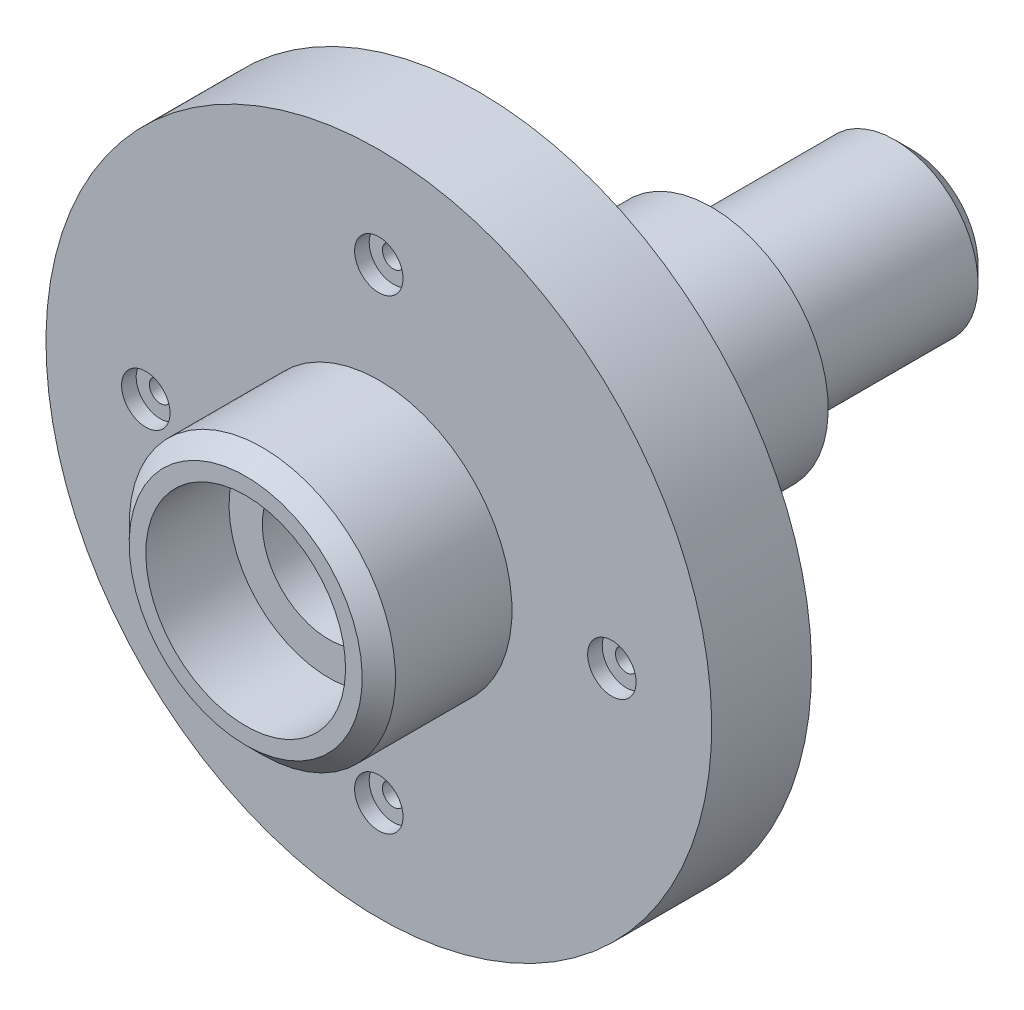
ISO-10303-21;
HEADER;
FILE_DESCRIPTION(('STEP AP214'),'2;1');
FILE_NAME('part.step','',(''),(''),'','','');
FILE_SCHEMA(('AUTOMOTIVE_DESIGN { 1 0 10303 214 1 1 1 1 }'));
ENDSEC;
DATA;
#1=APPLICATION_CONTEXT('core data for automotive mechanical design processes');
#2=APPLICATION_PROTOCOL_DEFINITION('international standard','automotive_design',2000,#1);
#3=PRODUCT_CONTEXT('',#1,'mechanical');
#4=PRODUCT('Part','Part','',(#3));
#5=PRODUCT_RELATED_PRODUCT_CATEGORY('part','',(#4));
#6=PRODUCT_DEFINITION_FORMATION('','',#4);
#7=PRODUCT_DEFINITION_CONTEXT('part definition',#1,'design');
#8=PRODUCT_DEFINITION('design','',#6,#7);
#9=PRODUCT_DEFINITION_SHAPE('','',#8);
#10=(LENGTH_UNIT() NAMED_UNIT(*) SI_UNIT(.MILLI.,.METRE.));
#11=(NAMED_UNIT(*) PLANE_ANGLE_UNIT() SI_UNIT($,.RADIAN.));
#12=(NAMED_UNIT(*) SI_UNIT($,.STERADIAN.) SOLID_ANGLE_UNIT());
#13=UNCERTAINTY_MEASURE_WITH_UNIT(LENGTH_MEASURE(1.E-05),#10,'distance_accuracy_value','');
#14=(GEOMETRIC_REPRESENTATION_CONTEXT(3) GLOBAL_UNCERTAINTY_ASSIGNED_CONTEXT((#13)) GLOBAL_UNIT_ASSIGNED_CONTEXT((#10,
#11,#12)) REPRESENTATION_CONTEXT('',''));
#15=CARTESIAN_POINT('',(0.,0.,0.));
#16=DIRECTION('',(0.,0.,1.));
#17=DIRECTION('',(1.,0.,0.));
#18=AXIS2_PLACEMENT_3D('',#15,#16,#17);
#19=CARTESIAN_POINT('',(0.,25.,0.));
#20=DIRECTION('',(0.,0.,-1.));
#21=DIRECTION('',(0.,1.,0.));
#22=AXIS2_PLACEMENT_3D('',#19,#20,#21);
#23=PLANE('',#22);
#24=CARTESIAN_POINT('',(0.,0.,0.));
#25=DIRECTION('',(0.,0.,-1.));
#26=DIRECTION('',(0.,1.,0.));
#27=AXIS2_PLACEMENT_3D('',#24,#25,#26);
#28=CIRCLE('',#27,9.24999999999999);
#29=CARTESIAN_POINT('',(0.,9.24999999999999,0.));
#30=VERTEX_POINT('',#29);
#31=EDGE_CURVE('E82',#30,#30,#28,.T.);
#32=ORIENTED_EDGE('',*,*,#31,.F.);
#33=EDGE_LOOP('',(#32));
#34=FACE_BOUND('',#33,.T.);
#35=CARTESIAN_POINT('',(0.,0.,0.));
#36=DIRECTION('',(0.,0.,-1.));
#37=DIRECTION('',(0.,1.,0.));
#38=AXIS2_PLACEMENT_3D('',#35,#36,#37);
#39=CIRCLE('',#38,20.0000000000001);
#40=CARTESIAN_POINT('',(0.,20.0000000000001,0.));
#41=VERTEX_POINT('',#40);
#42=EDGE_CURVE('E266',#41,#41,#39,.T.);
#43=ORIENTED_EDGE('',*,*,#42,.T.);
#44=EDGE_LOOP('',(#43));
#45=FACE_BOUND('',#44,.T.);
#46=ADVANCED_FACE('F40',(#34,#45),#23,.T.);
#47=CARTESIAN_POINT('',(0.,0.,0.));
#48=DIRECTION('',(0.,0.,-1.));
#49=DIRECTION('',(0.,1.,0.));
#50=AXIS2_PLACEMENT_3D('',#47,#48,#49);
#51=CYLINDRICAL_SURFACE('',#50,25.);
#52=CARTESIAN_POINT('',(0.,0.,4.99999999999999));
#53=DIRECTION('',(0.,0.,-1.));
#54=DIRECTION('',(0.,1.,0.));
#55=AXIS2_PLACEMENT_3D('',#52,#53,#54);
#56=CIRCLE('',#55,25.);
#57=CARTESIAN_POINT('',(0.,25.,4.99999999999999));
#58=VERTEX_POINT('',#57);
#59=EDGE_CURVE('E263',#58,#58,#56,.F.);
#60=ORIENTED_EDGE('',*,*,#59,.T.);
#61=EDGE_LOOP('',(#60));
#62=FACE_BOUND('',#61,.T.);
#63=CARTESIAN_POINT('',(0.,0.,60.));
#64=DIRECTION('',(0.,0.,-1.));
#65=DIRECTION('',(0.,1.,0.));
#66=AXIS2_PLACEMENT_3D('',#63,#64,#65);
#67=CIRCLE('',#66,25.);
#68=CARTESIAN_POINT('',(0.,25.,60.));
#69=VERTEX_POINT('',#68);
#70=EDGE_CURVE('E156',#69,#69,#67,.T.);
#71=ORIENTED_EDGE('',*,*,#70,.T.);
#72=EDGE_LOOP('',(#71));
#73=FACE_BOUND('',#72,.T.);
#74=ADVANCED_FACE('F233',(#62,#73),#51,.T.);
#75=CARTESIAN_POINT('',(0.,35.,60.));
#76=DIRECTION('',(0.,0.,-1.));
#77=DIRECTION('',(0.,1.,0.));
#78=AXIS2_PLACEMENT_3D('',#75,#76,#77);
#79=PLANE('',#78);
#80=CARTESIAN_POINT('',(0.,0.,60.));
#81=DIRECTION('',(0.,0.,-1.));
#82=DIRECTION('',(0.,1.,0.));
#83=AXIS2_PLACEMENT_3D('',#80,#81,#82);
#84=CIRCLE('',#83,35.);
#85=CARTESIAN_POINT('',(0.,35.,60.));
#86=VERTEX_POINT('',#85);
#87=EDGE_CURVE('E153',#86,#86,#84,.T.);
#88=ORIENTED_EDGE('',*,*,#87,.T.);
#89=EDGE_LOOP('',(#88));
#90=FACE_BOUND('',#89,.T.);
#91=ORIENTED_EDGE('',*,*,#70,.F.);
#92=EDGE_LOOP('',(#91));
#93=FACE_BOUND('',#92,.T.);
#94=ADVANCED_FACE('F228',(#90,#93),#79,.T.);
#95=CARTESIAN_POINT('',(0.,0.,0.));
#96=DIRECTION('',(0.,0.,-1.));
#97=DIRECTION('',(0.,1.,0.));
#98=AXIS2_PLACEMENT_3D('',#95,#96,#97);
#99=CYLINDRICAL_SURFACE('',#98,35.);
#100=DIRECTION('',(0.,0.,-1.));
#101=VECTOR('',#100,1.);
#102=CARTESIAN_POINT('',(10.,-33.5410196624969,0.));
#103=LINE('',#102,#101);
#104=CARTESIAN_POINT('',(10.,-33.5410196624969,64.9180948440976));
#105=VERTEX_POINT('',#104);
#106=CARTESIAN_POINT('',(10.,-33.5410196624969,115.081905155902));
#107=VERTEX_POINT('',#106);
#108=EDGE_CURVE('E62',#105,#107,#103,.F.);
#109=ORIENTED_EDGE('',*,*,#108,.F.);
#110=CARTESIAN_POINT('',(10.,-33.5410196624969,64.9180948440976));
#111=CARTESIAN_POINT('',(9.59845060295868,-33.6607514649792,64.839545568527));
#112=CARTESIAN_POINT('',(9.19372904055648,-33.7735514212323,64.7667321751121));
#113=CARTESIAN_POINT('',(8.37879790741143,-33.9848893569313,64.6320636996973));
#114=CARTESIAN_POINT('',(7.9685886252481,-34.0834280831288,64.5702080438866));
#115=CARTESIAN_POINT('',(7.14364584982962,-34.2658247972242,64.4569540243449));
#116=CARTESIAN_POINT('',(6.72891405248233,-34.349688099932,64.405551873704));
#117=CARTESIAN_POINT('',(5.89562437601432,-34.5024798359342,64.3127500488721));
#118=CARTESIAN_POINT('',(5.4770664636555,-34.5714081393571,64.2713504616609));
#119=CARTESIAN_POINT('',(4.24006682776616,-34.7520194622488,64.1636136746691));
#120=CARTESIAN_POINT('',(3.41723922779747,-34.8426132780873,64.1106433580321));
#121=CARTESIAN_POINT('',(1.76578200985539,-34.965239366976,64.0392434494645));
#122=CARTESIAN_POINT('',(0.937151842066425,-34.9972660130793,64.0208171764111));
#123=CARTESIAN_POINT('',(-0.737897715208506,-35.0024525843351,64.0178210484575));
#124=CARTESIAN_POINT('',(-1.58432263132521,-34.97435297598,64.0339756005816));
#125=CARTESIAN_POINT('',(-3.27153298615267,-34.8570201041887,64.102222477832));
#126=CARTESIAN_POINT('',(-4.11231876536465,-34.7677905660639,64.1543126130137));
#127=CARTESIAN_POINT('',(-5.37658407839591,-34.5872937340155,64.2618315830102));
#128=CARTESIAN_POINT('',(-5.80453751966936,-34.518036186317,64.3033685363203));
#129=CARTESIAN_POINT('',(-6.65650517215929,-34.3639093076495,64.3968587179929));
#130=CARTESIAN_POINT('',(-7.08051941660013,-34.2790401084796,64.4488118584187));
#131=CARTESIAN_POINT('',(-7.923852776155,-34.0939722228412,64.5636048387531));
#132=CARTESIAN_POINT('',(-8.34317024183908,-33.9937683216866,64.6264483829954));
#133=CARTESIAN_POINT('',(-9.1760958273764,-33.7784628384606,64.7635633184889));
#134=CARTESIAN_POINT('',(-9.58970363387191,-33.6633604422984,64.8378353342621));
#135=CARTESIAN_POINT('',(-10.,-33.5410196624969,64.9180948440976));
#136=B_SPLINE_CURVE_WITH_KNOTS('',3,(#110,#111,#112,#113,#114,#115,#116,#117,#118,#119,#120,
#121,#122,#123,#124,#125,#126,#127,#128,#129,#130,#131,#132,#133,#134,#135),.UNSPECIFIED.,.F.,
.F.,(4,2,2,2,2,2,2,2,2,2,2,2,4),(0.,1.2788248405163,2.55758269451853,3.83587647441616,
5.11418136963851,7.59957411008348,10.0852056265931,12.6234155189922,15.161470744416,
16.467640815109,17.7737998591545,19.0804040639262,20.3870796949689),.UNSPECIFIED.);
#137=CARTESIAN_POINT('',(-10.,-33.5410196624969,64.9180948440976));
#138=VERTEX_POINT('',#137);
#139=EDGE_CURVE('E171',#105,#138,#136,.T.);
#140=ORIENTED_EDGE('',*,*,#139,.T.);
#141=DIRECTION('',(0.,0.,-1.));
#142=VECTOR('',#141,1.);
#143=CARTESIAN_POINT('',(-10.,-33.5410196624969,0.));
#144=LINE('',#143,#142);
#145=CARTESIAN_POINT('',(-10.,-33.5410196624969,115.081905155902));
#146=VERTEX_POINT('',#145);
#147=EDGE_CURVE('E159',#138,#146,#144,.F.);
#148=ORIENTED_EDGE('',*,*,#147,.T.);
#149=CARTESIAN_POINT('',(-10.,-33.5410196624969,115.081905155902));
#150=CARTESIAN_POINT('',(-9.59845060295868,-33.6607514649792,115.160454431473));
#151=CARTESIAN_POINT('',(-9.19372904055648,-33.7735514212323,115.233267824888));
#152=CARTESIAN_POINT('',(-8.37879790741143,-33.9848893569313,115.367936300303));
#153=CARTESIAN_POINT('',(-7.9685886252481,-34.0834280831289,115.429791956114));
#154=CARTESIAN_POINT('',(-7.14364584982962,-34.2658247972242,115.543045975655));
#155=CARTESIAN_POINT('',(-6.72891405248233,-34.349688099932,115.594448126296));
#156=CARTESIAN_POINT('',(-5.89562437601432,-34.5024798359342,115.687249951128));
#157=CARTESIAN_POINT('',(-5.47706646365551,-34.5714081393571,115.728649538339));
#158=CARTESIAN_POINT('',(-4.24006682776616,-34.7520194622488,115.836386325331));
#159=CARTESIAN_POINT('',(-3.41723922779747,-34.8426132780873,115.889356641968));
#160=CARTESIAN_POINT('',(-1.7657820098554,-34.965239366976,115.960756550536));
#161=CARTESIAN_POINT('',(-0.93715184206643,-34.9972660130793,115.979182823589));
#162=CARTESIAN_POINT('',(0.737897715208501,-35.0024525843351,115.982178951543));
#163=CARTESIAN_POINT('',(1.58432263132521,-34.9743529759801,115.966024399418));
#164=CARTESIAN_POINT('',(3.27153298615267,-34.8570201041887,115.897777522168));
#165=CARTESIAN_POINT('',(4.11231876536465,-34.7677905660639,115.845687386986));
#166=CARTESIAN_POINT('',(5.37658407839591,-34.5872937340155,115.73816841699));
#167=CARTESIAN_POINT('',(5.80453751966936,-34.518036186317,115.69663146368));
#168=CARTESIAN_POINT('',(6.65650517215929,-34.3639093076495,115.603141282007));
#169=CARTESIAN_POINT('',(7.08051941660012,-34.2790401084796,115.551188141581));
#170=CARTESIAN_POINT('',(7.923852776155,-34.0939722228412,115.436395161247));
#171=CARTESIAN_POINT('',(8.34317024183908,-33.9937683216866,115.373551617005));
#172=CARTESIAN_POINT('',(9.1760958273764,-33.7784628384606,115.236436681511));
#173=CARTESIAN_POINT('',(9.5897036338719,-33.6633604422984,115.162164665738));
#174=CARTESIAN_POINT('',(10.,-33.5410196624969,115.081905155902));
#175=B_SPLINE_CURVE_WITH_KNOTS('',3,(#149,#150,#151,#152,#153,#154,#155,#156,#157,#158,#159,
#160,#161,#162,#163,#164,#165,#166,#167,#168,#169,#170,#171,#172,#173,#174),.UNSPECIFIED.,.F.,
.F.,(4,2,2,2,2,2,2,2,2,2,2,2,4),(0.,1.2788248405163,2.55758269451853,3.83587647441616,
5.11418136963851,7.59957411008348,10.0852056265931,12.6234155189922,15.161470744416,
16.467640815109,17.7737998591545,19.0804040639262,20.3870796949689),.UNSPECIFIED.);
#176=EDGE_CURVE('E162',#146,#107,#175,.T.);
#177=ORIENTED_EDGE('',*,*,#176,.T.);
#178=EDGE_LOOP('',(#109,#140,#148,#177));
#179=FACE_BOUND('',#178,.T.);
#180=CARTESIAN_POINT('',(0.,0.,130.));
#181=DIRECTION('',(0.,0.,-1.));
#182=DIRECTION('',(0.,1.,0.));
#183=AXIS2_PLACEMENT_3D('',#180,#181,#182);
#184=CIRCLE('',#183,35.);
#185=CARTESIAN_POINT('',(0.,35.,130.));
#186=VERTEX_POINT('',#185);
#187=EDGE_CURVE('E150',#186,#186,#184,.T.);
#188=ORIENTED_EDGE('',*,*,#187,.T.);
#189=EDGE_LOOP('',(#188));
#190=FACE_BOUND('',#189,.T.);
#191=ORIENTED_EDGE('',*,*,#87,.F.);
#192=EDGE_LOOP('',(#191));
#193=FACE_BOUND('',#192,.T.);
#194=ADVANCED_FACE('F177',(#179,#190,#193),#99,.T.);
#195=CARTESIAN_POINT('',(0.,100.,130.));
#196=DIRECTION('',(0.,0.,-1.));
#197=DIRECTION('',(0.,1.,0.));
#198=AXIS2_PLACEMENT_3D('',#195,#196,#197);
#199=PLANE('',#198);
#200=CARTESIAN_POINT('',(7.33211081157058E-13,70.,130.));
#201=DIRECTION('',(0.,0.,-1.));
#202=DIRECTION('',(0.,1.,0.));
#203=AXIS2_PLACEMENT_3D('',#200,#201,#202);
#204=CIRCLE('',#203,3.29999999999997);
#205=CARTESIAN_POINT('',(7.33211081157058E-13,73.3,130.));
#206=VERTEX_POINT('',#205);
#207=EDGE_CURVE('E95',#206,#206,#204,.T.);
#208=ORIENTED_EDGE('',*,*,#207,.F.);
#209=EDGE_LOOP('',(#208));
#210=FACE_BOUND('',#209,.T.);
#211=CARTESIAN_POINT('',(70.,0.,130.));
#212=DIRECTION('',(0.,0.,-1.));
#213=DIRECTION('',(0.,1.,0.));
#214=AXIS2_PLACEMENT_3D('',#211,#212,#213);
#215=CIRCLE('',#214,3.29999999999997);
#216=CARTESIAN_POINT('',(70.,3.29999999999995,130.));
#217=VERTEX_POINT('',#216);
#218=EDGE_CURVE('E105',#217,#217,#215,.T.);
#219=ORIENTED_EDGE('',*,*,#218,.F.);
#220=EDGE_LOOP('',(#219));
#221=FACE_BOUND('',#220,.T.);
#222=CARTESIAN_POINT('',(-2.44403693719019E-13,-70.,130.));
#223=DIRECTION('',(0.,0.,-1.));
#224=DIRECTION('',(0.,1.,0.));
#225=AXIS2_PLACEMENT_3D('',#222,#223,#224);
#226=CIRCLE('',#225,3.29999999999997);
#227=CARTESIAN_POINT('',(-2.44403693719019E-13,-66.7,130.));
#228=VERTEX_POINT('',#227);
#229=EDGE_CURVE('E115',#228,#228,#226,.T.);
#230=ORIENTED_EDGE('',*,*,#229,.F.);
#231=EDGE_LOOP('',(#230));
#232=FACE_BOUND('',#231,.T.);
#233=CARTESIAN_POINT('',(-70.,4.74258093768556E-13,130.));
#234=DIRECTION('',(0.,0.,-1.));
#235=DIRECTION('',(0.,1.,0.));
#236=AXIS2_PLACEMENT_3D('',#233,#234,#235);
#237=CIRCLE('',#236,3.29999999999997);
#238=CARTESIAN_POINT('',(-70.,3.30000000000044,130.));
#239=VERTEX_POINT('',#238);
#240=EDGE_CURVE('E125',#239,#239,#237,.T.);
#241=ORIENTED_EDGE('',*,*,#240,.F.);
#242=EDGE_LOOP('',(#241));
#243=FACE_BOUND('',#242,.T.);
#244=CARTESIAN_POINT('',(0.,0.,130.));
#245=DIRECTION('',(0.,0.,-1.));
#246=DIRECTION('',(0.,1.,0.));
#247=AXIS2_PLACEMENT_3D('',#244,#245,#246);
#248=CIRCLE('',#247,100.);
#249=CARTESIAN_POINT('',(0.,100.,130.));
#250=VERTEX_POINT('',#249);
#251=EDGE_CURVE('E147',#250,#250,#248,.T.);
#252=ORIENTED_EDGE('',*,*,#251,.T.);
#253=EDGE_LOOP('',(#252));
#254=FACE_BOUND('',#253,.T.);
#255=ORIENTED_EDGE('',*,*,#187,.F.);
#256=EDGE_LOOP('',(#255));
#257=FACE_BOUND('',#256,.T.);
#258=ADVANCED_FACE('F220',(#210,#221,#232,#243,#254,#257),#199,.T.);
#259=CARTESIAN_POINT('',(0.,0.,0.));
#260=DIRECTION('',(0.,0.,-1.));
#261=DIRECTION('',(0.,1.,0.));
#262=AXIS2_PLACEMENT_3D('',#259,#260,#261);
#263=CYLINDRICAL_SURFACE('',#262,100.);
#264=CARTESIAN_POINT('',(0.,0.,160.));
#265=DIRECTION('',(0.,0.,-1.));
#266=DIRECTION('',(0.,1.,0.));
#267=AXIS2_PLACEMENT_3D('',#264,#265,#266);
#268=CIRCLE('',#267,100.);
#269=CARTESIAN_POINT('',(0.,100.,160.));
#270=VERTEX_POINT('',#269);
#271=EDGE_CURVE('E144',#270,#270,#268,.T.);
#272=ORIENTED_EDGE('',*,*,#271,.T.);
#273=EDGE_LOOP('',(#272));
#274=FACE_BOUND('',#273,.T.);
#275=ORIENTED_EDGE('',*,*,#251,.F.);
#276=EDGE_LOOP('',(#275));
#277=FACE_BOUND('',#276,.T.);
#278=ADVANCED_FACE('F217',(#274,#277),#263,.T.);
#279=CARTESIAN_POINT('',(0.,40.,160.));
#280=DIRECTION('',(0.,0.,1.));
#281=DIRECTION('',(0.,-1.,0.));
#282=AXIS2_PLACEMENT_3D('',#279,#280,#281);
#283=PLANE('',#282);
#284=CARTESIAN_POINT('',(7.33211081157058E-13,70.,160.));
#285=DIRECTION('',(0.,0.,1.));
#286=DIRECTION('',(0.,-1.,0.));
#287=AXIS2_PLACEMENT_3D('',#284,#285,#286);
#288=CIRCLE('',#287,7.27499999999999);
#289=CARTESIAN_POINT('',(7.33211081157058E-13,62.725,160.));
#290=VERTEX_POINT('',#289);
#291=EDGE_CURVE('E81',#290,#290,#288,.T.);
#292=ORIENTED_EDGE('',*,*,#291,.F.);
#293=EDGE_LOOP('',(#292));
#294=FACE_BOUND('',#293,.T.);
#295=CARTESIAN_POINT('',(70.,0.,160.));
#296=DIRECTION('',(0.,0.,1.));
#297=DIRECTION('',(0.,-1.,0.));
#298=AXIS2_PLACEMENT_3D('',#295,#296,#297);
#299=CIRCLE('',#298,7.27499999999999);
#300=CARTESIAN_POINT('',(70.,-7.27500000000001,160.));
#301=VERTEX_POINT('',#300);
#302=EDGE_CURVE('E96',#301,#301,#299,.T.);
#303=ORIENTED_EDGE('',*,*,#302,.F.);
#304=EDGE_LOOP('',(#303));
#305=FACE_BOUND('',#304,.T.);
#306=CARTESIAN_POINT('',(-2.44403693719019E-13,-70.,160.));
#307=DIRECTION('',(0.,0.,1.));
#308=DIRECTION('',(0.,-1.,0.));
#309=AXIS2_PLACEMENT_3D('',#306,#307,#308);
#310=CIRCLE('',#309,7.27499999999999);
#311=CARTESIAN_POINT('',(-2.44403693719019E-13,-77.275,160.));
#312=VERTEX_POINT('',#311);
#313=EDGE_CURVE('E106',#312,#312,#310,.T.);
#314=ORIENTED_EDGE('',*,*,#313,.F.);
#315=EDGE_LOOP('',(#314));
#316=FACE_BOUND('',#315,.T.);
#317=CARTESIAN_POINT('',(-70.,4.70900564460214E-13,160.));
#318=DIRECTION('',(0.,0.,1.));
#319=DIRECTION('',(0.,-1.,0.));
#320=AXIS2_PLACEMENT_3D('',#317,#318,#319);
#321=CIRCLE('',#320,7.27499999999999);
#322=CARTESIAN_POINT('',(-70.,-7.27499999999952,160.));
#323=VERTEX_POINT('',#322);
#324=EDGE_CURVE('E116',#323,#323,#321,.T.);
#325=ORIENTED_EDGE('',*,*,#324,.F.);
#326=EDGE_LOOP('',(#325));
#327=FACE_BOUND('',#326,.T.);
#328=CARTESIAN_POINT('',(0.,0.,160.));
#329=DIRECTION('',(0.,0.,-1.));
#330=DIRECTION('',(0.,1.,0.));
#331=AXIS2_PLACEMENT_3D('',#328,#329,#330);
#332=CIRCLE('',#331,40.);
#333=CARTESIAN_POINT('',(0.,40.,160.));
#334=VERTEX_POINT('',#333);
#335=EDGE_CURVE('E141',#334,#334,#332,.T.);
#336=ORIENTED_EDGE('',*,*,#335,.T.);
#337=EDGE_LOOP('',(#336));
#338=FACE_BOUND('',#337,.T.);
#339=ORIENTED_EDGE('',*,*,#271,.F.);
#340=EDGE_LOOP('',(#339));
#341=FACE_BOUND('',#340,.T.);
#342=ADVANCED_FACE('F213',(#294,#305,#316,#327,#338,#341),#283,.T.);
#343=CARTESIAN_POINT('',(0.,0.,0.));
#344=DIRECTION('',(0.,0.,-1.));
#345=DIRECTION('',(0.,1.,0.));
#346=AXIS2_PLACEMENT_3D('',#343,#344,#345);
#347=CYLINDRICAL_SURFACE('',#346,40.);
#348=CARTESIAN_POINT('',(0.,0.,195.));
#349=DIRECTION('',(0.,0.,1.));
#350=DIRECTION('',(0.,-1.,0.));
#351=AXIS2_PLACEMENT_3D('',#348,#349,#350);
#352=CIRCLE('',#351,40.);
#353=CARTESIAN_POINT('',(0.,-40.,195.));
#354=VERTEX_POINT('',#353);
#355=EDGE_CURVE('E49',#354,#354,#352,.F.);
#356=ORIENTED_EDGE('',*,*,#355,.T.);
#357=EDGE_LOOP('',(#356));
#358=FACE_BOUND('',#357,.T.);
#359=ORIENTED_EDGE('',*,*,#335,.F.);
#360=EDGE_LOOP('',(#359));
#361=FACE_BOUND('',#360,.T.);
#362=ADVANCED_FACE('F209',(#358,#361),#347,.T.);
#363=CARTESIAN_POINT('',(0.,30.,200.));
#364=DIRECTION('',(0.,0.,1.));
#365=DIRECTION('',(0.,-1.,0.));
#366=AXIS2_PLACEMENT_3D('',#363,#364,#365);
#367=PLANE('',#366);
#368=CARTESIAN_POINT('',(0.,0.,200.));
#369=DIRECTION('',(0.,0.,1.));
#370=DIRECTION('',(0.,-1.,0.));
#371=AXIS2_PLACEMENT_3D('',#368,#369,#370);
#372=CIRCLE('',#371,34.9999999999999);
#373=CARTESIAN_POINT('',(0.,-34.9999999999999,200.));
#374=VERTEX_POINT('',#373);
#375=EDGE_CURVE('E11',#374,#374,#372,.T.);
#376=ORIENTED_EDGE('',*,*,#375,.T.);
#377=EDGE_LOOP('',(#376));
#378=FACE_BOUND('',#377,.T.);
#379=CARTESIAN_POINT('',(0.,0.,200.));
#380=DIRECTION('',(0.,0.,-1.));
#381=DIRECTION('',(0.,1.,0.));
#382=AXIS2_PLACEMENT_3D('',#379,#380,#381);
#383=CIRCLE('',#382,30.);
#384=CARTESIAN_POINT('',(0.,30.,200.));
#385=VERTEX_POINT('',#384);
#386=EDGE_CURVE('E138',#385,#385,#383,.T.);
#387=ORIENTED_EDGE('',*,*,#386,.T.);
#388=EDGE_LOOP('',(#387));
#389=FACE_BOUND('',#388,.T.);
#390=ADVANCED_FACE('F205',(#378,#389),#367,.T.);
#391=CARTESIAN_POINT('',(0.,0.,0.));
#392=DIRECTION('',(0.,0.,-1.));
#393=DIRECTION('',(0.,1.,0.));
#394=AXIS2_PLACEMENT_3D('',#391,#392,#393);
#395=CYLINDRICAL_SURFACE('',#394,30.);
#396=CARTESIAN_POINT('',(0.,0.,175.));
#397=DIRECTION('',(0.,0.,-1.));
#398=DIRECTION('',(0.,1.,0.));
#399=AXIS2_PLACEMENT_3D('',#396,#397,#398);
#400=CIRCLE('',#399,30.);
#401=CARTESIAN_POINT('',(0.,30.,175.));
#402=VERTEX_POINT('',#401);
#403=EDGE_CURVE('E135',#402,#402,#400,.T.);
#404=ORIENTED_EDGE('',*,*,#403,.T.);
#405=EDGE_LOOP('',(#404));
#406=FACE_BOUND('',#405,.T.);
#407=ORIENTED_EDGE('',*,*,#386,.F.);
#408=EDGE_LOOP('',(#407));
#409=FACE_BOUND('',#408,.T.);
#410=ADVANCED_FACE('F201',(#406,#409),#395,.F.);
#411=CARTESIAN_POINT('',(0.,30.,175.));
#412=DIRECTION('',(0.,0.,1.));
#413=DIRECTION('',(0.,-1.,0.));
#414=AXIS2_PLACEMENT_3D('',#411,#412,#413);
#415=PLANE('',#414);
#416=CARTESIAN_POINT('',(0.,0.,175.));
#417=DIRECTION('',(0.,0.,-1.));
#418=DIRECTION('',(0.,1.,0.));
#419=AXIS2_PLACEMENT_3D('',#416,#417,#418);
#420=CIRCLE('',#419,20.);
#421=CARTESIAN_POINT('',(0.,20.,175.));
#422=VERTEX_POINT('',#421);
#423=EDGE_CURVE('E132',#422,#422,#420,.T.);
#424=ORIENTED_EDGE('',*,*,#423,.T.);
#425=EDGE_LOOP('',(#424));
#426=FACE_BOUND('',#425,.T.);
#427=ORIENTED_EDGE('',*,*,#403,.F.);
#428=EDGE_LOOP('',(#427));
#429=FACE_BOUND('',#428,.T.);
#430=ADVANCED_FACE('F197',(#426,#429),#415,.T.);
#431=CARTESIAN_POINT('',(0.,0.,0.));
#432=DIRECTION('',(0.,0.,-1.));
#433=DIRECTION('',(0.,1.,0.));
#434=AXIS2_PLACEMENT_3D('',#431,#432,#433);
#435=CYLINDRICAL_SURFACE('',#434,20.);
#436=CARTESIAN_POINT('',(0.,0.,155.));
#437=DIRECTION('',(0.,0.,-1.));
#438=DIRECTION('',(0.,1.,0.));
#439=AXIS2_PLACEMENT_3D('',#436,#437,#438);
#440=CIRCLE('',#439,20.);
#441=CARTESIAN_POINT('',(0.,20.,155.));
#442=VERTEX_POINT('',#441);
#443=EDGE_CURVE('E129',#442,#442,#440,.T.);
#444=ORIENTED_EDGE('',*,*,#443,.T.);
#445=EDGE_LOOP('',(#444));
#446=FACE_BOUND('',#445,.T.);
#447=ORIENTED_EDGE('',*,*,#423,.F.);
#448=EDGE_LOOP('',(#447));
#449=FACE_BOUND('',#448,.T.);
#450=ADVANCED_FACE('F193',(#446,#449),#435,.F.);
#451=CARTESIAN_POINT('',(0.,20.,155.));
#452=DIRECTION('',(0.,0.,1.));
#453=DIRECTION('',(0.,-1.,0.));
#454=AXIS2_PLACEMENT_3D('',#451,#452,#453);
#455=PLANE('',#454);
#456=ORIENTED_EDGE('',*,*,#443,.F.);
#457=EDGE_LOOP('',(#456));
#458=FACE_BOUND('',#457,.T.);
#459=ADVANCED_FACE('F187',(#458),#455,.T.);
#460=CARTESIAN_POINT('',(10.,-50.,90.));
#461=DIRECTION('',(-1.,0.,0.));
#462=DIRECTION('',(0.,0.,1.));
#463=AXIS2_PLACEMENT_3D('',#460,#461,#462);
#464=CYLINDRICAL_SURFACE('',#463,30.);
#465=CARTESIAN_POINT('',(10.,-50.,90.));
#466=DIRECTION('',(1.,0.,0.));
#467=DIRECTION('',(0.,0.,-1.));
#468=AXIS2_PLACEMENT_3D('',#465,#466,#467);
#469=CIRCLE('',#468,30.);
#470=EDGE_CURVE('E127',#105,#107,#469,.T.);
#471=ORIENTED_EDGE('',*,*,#470,.T.);
#472=ORIENTED_EDGE('',*,*,#176,.F.);
#473=CARTESIAN_POINT('',(-10.,-50.,90.));
#474=DIRECTION('',(1.,0.,0.));
#475=DIRECTION('',(0.,0.,-1.));
#476=AXIS2_PLACEMENT_3D('',#473,#474,#475);
#477=CIRCLE('',#476,30.);
#478=EDGE_CURVE('E55',#138,#146,#477,.T.);
#479=ORIENTED_EDGE('',*,*,#478,.F.);
#480=ORIENTED_EDGE('',*,*,#139,.F.);
#481=EDGE_LOOP('',(#471,#472,#479,#480));
#482=FACE_BOUND('',#481,.T.);
#483=ADVANCED_FACE('F181',(#482),#464,.F.);
#484=CARTESIAN_POINT('',(10.,-50.,90.));
#485=DIRECTION('',(1.,0.,0.));
#486=DIRECTION('',(0.,0.,-1.));
#487=AXIS2_PLACEMENT_3D('',#484,#485,#486);
#488=PLANE('',#487);
#489=ORIENTED_EDGE('',*,*,#108,.T.);
#490=ORIENTED_EDGE('',*,*,#470,.F.);
#491=EDGE_LOOP('',(#489,#490));
#492=FACE_BOUND('',#491,.T.);
#493=ADVANCED_FACE('F186',(#492),#488,.F.);
#494=CARTESIAN_POINT('',(-10.,-50.,90.));
#495=DIRECTION('',(1.,0.,0.));
#496=DIRECTION('',(0.,0.,-1.));
#497=AXIS2_PLACEMENT_3D('',#494,#495,#496);
#498=PLANE('',#497);
#499=ORIENTED_EDGE('',*,*,#478,.T.);
#500=ORIENTED_EDGE('',*,*,#147,.F.);
#501=EDGE_LOOP('',(#499,#500));
#502=FACE_BOUND('',#501,.T.);
#503=ADVANCED_FACE('F355',(#502),#498,.T.);
#504=CARTESIAN_POINT('',(-70.,4.70900564460214E-13,160.));
#505=DIRECTION('',(0.,0.,1.));
#506=DIRECTION('',(0.,-1.,0.));
#507=AXIS2_PLACEMENT_3D('',#504,#505,#506);
#508=CYLINDRICAL_SURFACE('',#507,3.29999999999997);
#509=ORIENTED_EDGE('',*,*,#240,.T.);
#510=EDGE_LOOP('',(#509));
#511=FACE_BOUND('',#510,.T.);
#512=CARTESIAN_POINT('',(-70.,4.71390763739232E-13,155.62));
#513=DIRECTION('',(0.,0.,1.));
#514=DIRECTION('',(0.,-1.,0.));
#515=AXIS2_PLACEMENT_3D('',#512,#513,#514);
#516=CIRCLE('',#515,3.3);
#517=CARTESIAN_POINT('',(-70.,-3.29999999999953,155.62));
#518=VERTEX_POINT('',#517);
#519=EDGE_CURVE('E122',#518,#518,#516,.T.);
#520=ORIENTED_EDGE('',*,*,#519,.T.);
#521=EDGE_LOOP('',(#520));
#522=FACE_BOUND('',#521,.T.);
#523=ADVANCED_FACE('F360',(#511,#522),#508,.F.);
#524=CARTESIAN_POINT('',(-66.7,4.71390763739232E-13,155.62));
#525=DIRECTION('',(0.,0.,-1.));
#526=DIRECTION('',(0.,1.,0.));
#527=AXIS2_PLACEMENT_3D('',#524,#525,#526);
#528=PLANE('',#527);
#529=ORIENTED_EDGE('',*,*,#519,.F.);
#530=EDGE_LOOP('',(#529));
#531=FACE_BOUND('',#530,.T.);
#532=CARTESIAN_POINT('',(-70.,4.71390763739232E-13,155.62));
#533=DIRECTION('',(0.,0.,1.));
#534=DIRECTION('',(0.,-1.,0.));
#535=AXIS2_PLACEMENT_3D('',#532,#533,#534);
#536=CIRCLE('',#535,7.275);
#537=CARTESIAN_POINT('',(-70.,-7.27499999999953,155.62));
#538=VERTEX_POINT('',#537);
#539=EDGE_CURVE('E119',#538,#538,#536,.T.);
#540=ORIENTED_EDGE('',*,*,#539,.T.);
#541=EDGE_LOOP('',(#540));
#542=FACE_BOUND('',#541,.T.);
#543=ADVANCED_FACE('F365',(#531,#542),#528,.F.);
#544=CARTESIAN_POINT('',(-70.,4.70900564460214E-13,160.));
#545=DIRECTION('',(0.,0.,1.));
#546=DIRECTION('',(0.,-1.,0.));
#547=AXIS2_PLACEMENT_3D('',#544,#545,#546);
#548=CYLINDRICAL_SURFACE('',#547,7.275);
#549=ORIENTED_EDGE('',*,*,#539,.F.);
#550=EDGE_LOOP('',(#549));
#551=FACE_BOUND('',#550,.T.);
#552=ORIENTED_EDGE('',*,*,#324,.T.);
#553=EDGE_LOOP('',(#552));
#554=FACE_BOUND('',#553,.T.);
#555=ADVANCED_FACE('F373',(#551,#554),#548,.F.);
#556=CARTESIAN_POINT('',(-2.44403693719019E-13,-70.,160.));
#557=DIRECTION('',(0.,0.,1.));
#558=DIRECTION('',(0.,-1.,0.));
#559=AXIS2_PLACEMENT_3D('',#556,#557,#558);
#560=CYLINDRICAL_SURFACE('',#559,3.29999999999997);
#561=ORIENTED_EDGE('',*,*,#229,.T.);
#562=EDGE_LOOP('',(#561));
#563=FACE_BOUND('',#562,.T.);
#564=CARTESIAN_POINT('',(-2.44403693719019E-13,-70.,155.62));
#565=DIRECTION('',(0.,0.,1.));
#566=DIRECTION('',(0.,-1.,0.));
#567=AXIS2_PLACEMENT_3D('',#564,#565,#566);
#568=CIRCLE('',#567,3.3);
#569=CARTESIAN_POINT('',(-2.44403693719019E-13,-73.3,155.62));
#570=VERTEX_POINT('',#569);
#571=EDGE_CURVE('E112',#570,#570,#568,.T.);
#572=ORIENTED_EDGE('',*,*,#571,.T.);
#573=EDGE_LOOP('',(#572));
#574=FACE_BOUND('',#573,.T.);
#575=ADVANCED_FACE('F381',(#563,#574),#560,.F.);
#576=CARTESIAN_POINT('',(3.29999999999975,-70.,155.62));
#577=DIRECTION('',(0.,0.,-1.));
#578=DIRECTION('',(0.,1.,0.));
#579=AXIS2_PLACEMENT_3D('',#576,#577,#578);
#580=PLANE('',#579);
#581=ORIENTED_EDGE('',*,*,#571,.F.);
#582=EDGE_LOOP('',(#581));
#583=FACE_BOUND('',#582,.T.);
#584=CARTESIAN_POINT('',(-2.44403693719019E-13,-70.,155.62));
#585=DIRECTION('',(0.,0.,1.));
#586=DIRECTION('',(0.,-1.,0.));
#587=AXIS2_PLACEMENT_3D('',#584,#585,#586);
#588=CIRCLE('',#587,7.275);
#589=CARTESIAN_POINT('',(-2.44403693719019E-13,-77.275,155.62));
#590=VERTEX_POINT('',#589);
#591=EDGE_CURVE('E109',#590,#590,#588,.T.);
#592=ORIENTED_EDGE('',*,*,#591,.T.);
#593=EDGE_LOOP('',(#592));
#594=FACE_BOUND('',#593,.T.);
#595=ADVANCED_FACE('F389',(#583,#594),#580,.F.);
#596=CARTESIAN_POINT('',(-2.44403693719019E-13,-70.,160.));
#597=DIRECTION('',(0.,0.,1.));
#598=DIRECTION('',(0.,-1.,0.));
#599=AXIS2_PLACEMENT_3D('',#596,#597,#598);
#600=CYLINDRICAL_SURFACE('',#599,7.275);
#601=ORIENTED_EDGE('',*,*,#591,.F.);
#602=EDGE_LOOP('',(#601));
#603=FACE_BOUND('',#602,.T.);
#604=ORIENTED_EDGE('',*,*,#313,.T.);
#605=EDGE_LOOP('',(#604));
#606=FACE_BOUND('',#605,.T.);
#607=ADVANCED_FACE('F397',(#603,#606),#600,.F.);
#608=CARTESIAN_POINT('',(70.,0.,160.));
#609=DIRECTION('',(0.,0.,1.));
#610=DIRECTION('',(0.,-1.,0.));
#611=AXIS2_PLACEMENT_3D('',#608,#609,#610);
#612=CYLINDRICAL_SURFACE('',#611,3.29999999999997);
#613=ORIENTED_EDGE('',*,*,#218,.T.);
#614=EDGE_LOOP('',(#613));
#615=FACE_BOUND('',#614,.T.);
#616=CARTESIAN_POINT('',(70.,0.,155.62));
#617=DIRECTION('',(0.,0.,1.));
#618=DIRECTION('',(0.,-1.,0.));
#619=AXIS2_PLACEMENT_3D('',#616,#617,#618);
#620=CIRCLE('',#619,3.3);
#621=CARTESIAN_POINT('',(70.,-3.30000000000001,155.62));
#622=VERTEX_POINT('',#621);
#623=EDGE_CURVE('E102',#622,#622,#620,.T.);
#624=ORIENTED_EDGE('',*,*,#623,.T.);
#625=EDGE_LOOP('',(#624));
#626=FACE_BOUND('',#625,.T.);
#627=ADVANCED_FACE('F405',(#615,#626),#612,.F.);
#628=CARTESIAN_POINT('',(73.3,0.,155.62));
#629=DIRECTION('',(0.,0.,-1.));
#630=DIRECTION('',(0.,1.,0.));
#631=AXIS2_PLACEMENT_3D('',#628,#629,#630);
#632=PLANE('',#631);
#633=ORIENTED_EDGE('',*,*,#623,.F.);
#634=EDGE_LOOP('',(#633));
#635=FACE_BOUND('',#634,.T.);
#636=CARTESIAN_POINT('',(70.,0.,155.62));
#637=DIRECTION('',(0.,0.,1.));
#638=DIRECTION('',(0.,-1.,0.));
#639=AXIS2_PLACEMENT_3D('',#636,#637,#638);
#640=CIRCLE('',#639,7.275);
#641=CARTESIAN_POINT('',(70.,-7.27500000000002,155.62));
#642=VERTEX_POINT('',#641);
#643=EDGE_CURVE('E99',#642,#642,#640,.T.);
#644=ORIENTED_EDGE('',*,*,#643,.T.);
#645=EDGE_LOOP('',(#644));
#646=FACE_BOUND('',#645,.T.);
#647=ADVANCED_FACE('F413',(#635,#646),#632,.F.);
#648=CARTESIAN_POINT('',(70.,0.,160.));
#649=DIRECTION('',(0.,0.,1.));
#650=DIRECTION('',(0.,-1.,0.));
#651=AXIS2_PLACEMENT_3D('',#648,#649,#650);
#652=CYLINDRICAL_SURFACE('',#651,7.275);
#653=ORIENTED_EDGE('',*,*,#643,.F.);
#654=EDGE_LOOP('',(#653));
#655=FACE_BOUND('',#654,.T.);
#656=ORIENTED_EDGE('',*,*,#302,.T.);
#657=EDGE_LOOP('',(#656));
#658=FACE_BOUND('',#657,.T.);
#659=ADVANCED_FACE('F421',(#655,#658),#652,.F.);
#660=CARTESIAN_POINT('',(7.33211081157058E-13,70.,160.));
#661=DIRECTION('',(0.,0.,1.));
#662=DIRECTION('',(0.,-1.,0.));
#663=AXIS2_PLACEMENT_3D('',#660,#661,#662);
#664=CYLINDRICAL_SURFACE('',#663,3.29999999999997);
#665=ORIENTED_EDGE('',*,*,#207,.T.);
#666=EDGE_LOOP('',(#665));
#667=FACE_BOUND('',#666,.T.);
#668=CARTESIAN_POINT('',(7.33211081157058E-13,70.,155.62));
#669=DIRECTION('',(0.,0.,1.));
#670=DIRECTION('',(0.,-1.,0.));
#671=AXIS2_PLACEMENT_3D('',#668,#669,#670);
#672=CIRCLE('',#671,3.3);
#673=CARTESIAN_POINT('',(7.33211081157058E-13,66.7,155.62));
#674=VERTEX_POINT('',#673);
#675=EDGE_CURVE('E92',#674,#674,#672,.T.);
#676=ORIENTED_EDGE('',*,*,#675,.T.);
#677=EDGE_LOOP('',(#676));
#678=FACE_BOUND('',#677,.T.);
#679=ADVANCED_FACE('F429',(#667,#678),#664,.F.);
#680=CARTESIAN_POINT('',(3.30000000000073,70.,155.62));
#681=DIRECTION('',(0.,0.,-1.));
#682=DIRECTION('',(0.,1.,0.));
#683=AXIS2_PLACEMENT_3D('',#680,#681,#682);
#684=PLANE('',#683);
#685=ORIENTED_EDGE('',*,*,#675,.F.);
#686=EDGE_LOOP('',(#685));
#687=FACE_BOUND('',#686,.T.);
#688=CARTESIAN_POINT('',(7.33211081157058E-13,70.,155.62));
#689=DIRECTION('',(0.,0.,1.));
#690=DIRECTION('',(0.,-1.,0.));
#691=AXIS2_PLACEMENT_3D('',#688,#689,#690);
#692=CIRCLE('',#691,7.275);
#693=CARTESIAN_POINT('',(7.33211081157058E-13,62.725,155.62));
#694=VERTEX_POINT('',#693);
#695=EDGE_CURVE('E85',#694,#694,#692,.T.);
#696=ORIENTED_EDGE('',*,*,#695,.T.);
#697=EDGE_LOOP('',(#696));
#698=FACE_BOUND('',#697,.T.);
#699=ADVANCED_FACE('F257',(#687,#698),#684,.F.);
#700=CARTESIAN_POINT('',(7.33211081157058E-13,70.,160.));
#701=DIRECTION('',(0.,0.,1.));
#702=DIRECTION('',(0.,-1.,0.));
#703=AXIS2_PLACEMENT_3D('',#700,#701,#702);
#704=CYLINDRICAL_SURFACE('',#703,7.275);
#705=ORIENTED_EDGE('',*,*,#695,.F.);
#706=EDGE_LOOP('',(#705));
#707=FACE_BOUND('',#706,.T.);
#708=ORIENTED_EDGE('',*,*,#291,.T.);
#709=EDGE_LOOP('',(#708));
#710=FACE_BOUND('',#709,.T.);
#711=ADVANCED_FACE('F250',(#707,#710),#704,.F.);
#712=CARTESIAN_POINT('',(0.,0.,0.));
#713=DIRECTION('',(0.,0.,1.));
#714=DIRECTION('',(0.,-1.,0.));
#715=AXIS2_PLACEMENT_3D('',#712,#713,#714);
#716=CONICAL_SURFACE('',#715,20.0000000000001,0.785398163397442);
#717=ORIENTED_EDGE('',*,*,#59,.F.);
#718=EDGE_LOOP('',(#717));
#719=FACE_BOUND('',#718,.T.);
#720=ORIENTED_EDGE('',*,*,#42,.F.);
#721=EDGE_LOOP('',(#720));
#722=FACE_BOUND('',#721,.T.);
#723=ADVANCED_FACE('F246',(#719,#722),#716,.T.);
#724=CARTESIAN_POINT('',(0.,0.,195.));
#725=DIRECTION('',(0.,0.,-1.));
#726=DIRECTION('',(0.,1.,0.));
#727=AXIS2_PLACEMENT_3D('',#724,#725,#726);
#728=CONICAL_SURFACE('',#727,40.,0.785398163397454);
#729=ORIENTED_EDGE('',*,*,#375,.F.);
#730=EDGE_LOOP('',(#729));
#731=FACE_BOUND('',#730,.T.);
#732=ORIENTED_EDGE('',*,*,#355,.F.);
#733=EDGE_LOOP('',(#732));
#734=FACE_BOUND('',#733,.T.);
#735=ADVANCED_FACE('F43',(#731,#734),#728,.T.);
#736=CARTESIAN_POINT('',(0.,0.,50.));
#737=DIRECTION('',(0.,0.,-1.));
#738=DIRECTION('',(0.,1.,0.));
#739=AXIS2_PLACEMENT_3D('',#736,#737,#738);
#740=CONICAL_SURFACE('',#739,9.24999999999998,1.02974425867665);
#741=CARTESIAN_POINT('',(0.,0.,55.5579607260049));
#742=VERTEX_POINT('',#741);
#743=VERTEX_LOOP('',#742);
#744=FACE_BOUND('',#743,.T.);
#745=CARTESIAN_POINT('',(0.,0.,50.));
#746=DIRECTION('',(0.,0.,-1.));
#747=DIRECTION('',(0.,1.,0.));
#748=AXIS2_PLACEMENT_3D('',#745,#746,#747);
#749=CIRCLE('',#748,9.24999999999998);
#750=CARTESIAN_POINT('',(0.,9.24999999999997,50.));
#751=VERTEX_POINT('',#750);
#752=EDGE_CURVE('E79',#751,#751,#749,.T.);
#753=ORIENTED_EDGE('',*,*,#752,.T.);
#754=EDGE_LOOP('',(#753));
#755=FACE_BOUND('',#754,.T.);
#756=ADVANCED_FACE('F72',(#744,#755),#740,.F.);
#757=CARTESIAN_POINT('',(0.,0.,0.));
#758=DIRECTION('',(0.,0.,-1.));
#759=DIRECTION('',(0.,1.,0.));
#760=AXIS2_PLACEMENT_3D('',#757,#758,#759);
#761=CYLINDRICAL_SURFACE('',#760,9.24999999999998);
#762=ORIENTED_EDGE('',*,*,#752,.F.);
#763=EDGE_LOOP('',(#762));
#764=FACE_BOUND('',#763,.T.);
#765=ORIENTED_EDGE('',*,*,#31,.T.);
#766=EDGE_LOOP('',(#765));
#767=FACE_BOUND('',#766,.T.);
#768=ADVANCED_FACE('F75',(#764,#767),#761,.F.);
#769=CLOSED_SHELL('',(#46,#74,#94,#194,#258,#278,#342,#362,#390,#410,#430,#450,#459,#483,#493,
#503,#523,#543,#555,#575,#595,#607,#627,#647,#659,#679,#699,#711,#723,#735,#756,#768));
#770=MANIFOLD_SOLID_BREP('B2',#769);
#771=ADVANCED_BREP_SHAPE_REPRESENTATION('',(#18,#770),#14);
#772=SHAPE_DEFINITION_REPRESENTATION(#9,#771);
ENDSEC;
END-ISO-10303-21;
